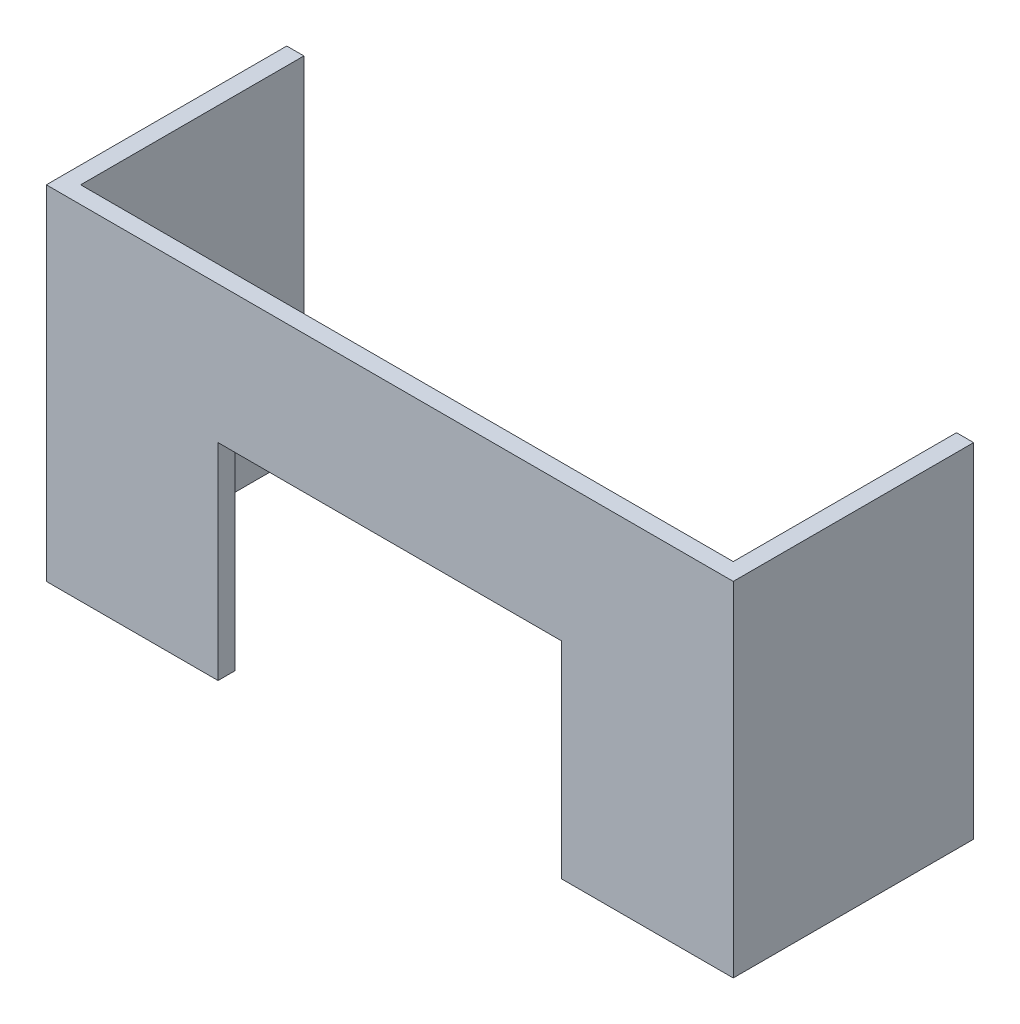
ISO-10303-21;
HEADER;
FILE_DESCRIPTION(('STEP AP214'),'2;1');
FILE_NAME('part.step','',(''),(''),'','','');
FILE_SCHEMA(('AUTOMOTIVE_DESIGN { 1 0 10303 214 1 1 1 1 }'));
ENDSEC;
DATA;
#1=APPLICATION_CONTEXT('core data for automotive mechanical design processes');
#2=APPLICATION_PROTOCOL_DEFINITION('international standard','automotive_design',2000,#1);
#3=PRODUCT_CONTEXT('',#1,'mechanical');
#4=PRODUCT('Part','Part','',(#3));
#5=PRODUCT_RELATED_PRODUCT_CATEGORY('part','',(#4));
#6=PRODUCT_DEFINITION_FORMATION('','',#4);
#7=PRODUCT_DEFINITION_CONTEXT('part definition',#1,'design');
#8=PRODUCT_DEFINITION('design','',#6,#7);
#9=PRODUCT_DEFINITION_SHAPE('','',#8);
#10=(LENGTH_UNIT() NAMED_UNIT(*) SI_UNIT(.MILLI.,.METRE.));
#11=(NAMED_UNIT(*) PLANE_ANGLE_UNIT() SI_UNIT($,.RADIAN.));
#12=(NAMED_UNIT(*) SI_UNIT($,.STERADIAN.) SOLID_ANGLE_UNIT());
#13=UNCERTAINTY_MEASURE_WITH_UNIT(LENGTH_MEASURE(1.E-05),#10,'distance_accuracy_value','');
#14=(GEOMETRIC_REPRESENTATION_CONTEXT(3) GLOBAL_UNCERTAINTY_ASSIGNED_CONTEXT((#13)) GLOBAL_UNIT_ASSIGNED_CONTEXT((#10,
#11,#12)) REPRESENTATION_CONTEXT('',''));
#15=CARTESIAN_POINT('',(0.,0.,0.));
#16=DIRECTION('',(0.,0.,1.));
#17=DIRECTION('',(1.,0.,0.));
#18=AXIS2_PLACEMENT_3D('',#15,#16,#17);
#19=CARTESIAN_POINT('',(200.,200.,-75.));
#20=DIRECTION('',(-1.,0.,0.));
#21=DIRECTION('',(0.,0.,1.));
#22=AXIS2_PLACEMENT_3D('',#19,#20,#21);
#23=PLANE('',#22);
#24=DIRECTION('',(0.,-1.,0.));
#25=VECTOR('',#24,1.);
#26=CARTESIAN_POINT('',(200.,200.,-65.));
#27=LINE('',#26,#25);
#28=CARTESIAN_POINT('',(200.,200.,-65.));
#29=VERTEX_POINT('',#28);
#30=CARTESIAN_POINT('',(200.,0.,-65.));
#31=VERTEX_POINT('',#30);
#32=EDGE_CURVE('E244',#29,#31,#27,.T.);
#33=ORIENTED_EDGE('',*,*,#32,.F.);
#34=DIRECTION('',(0.,0.,-1.));
#35=VECTOR('',#34,1.);
#36=CARTESIAN_POINT('',(200.,200.,-75.));
#37=LINE('',#36,#35);
#38=CARTESIAN_POINT('',(200.,200.,75.));
#39=VERTEX_POINT('',#38);
#40=EDGE_CURVE('E94',#39,#29,#37,.T.);
#41=ORIENTED_EDGE('',*,*,#40,.F.);
#42=DIRECTION('',(0.,-1.,0.));
#43=VECTOR('',#42,1.);
#44=CARTESIAN_POINT('',(200.,200.,75.));
#45=LINE('',#44,#43);
#46=CARTESIAN_POINT('',(200.,0.,75.));
#47=VERTEX_POINT('',#46);
#48=EDGE_CURVE('E78',#39,#47,#45,.T.);
#49=ORIENTED_EDGE('',*,*,#48,.T.);
#50=DIRECTION('',(0.,0.,-1.));
#51=VECTOR('',#50,1.);
#52=CARTESIAN_POINT('',(200.,0.,-75.));
#53=LINE('',#52,#51);
#54=EDGE_CURVE('E93',#47,#31,#53,.T.);
#55=ORIENTED_EDGE('',*,*,#54,.T.);
#56=EDGE_LOOP('',(#33,#41,#49,#55));
#57=FACE_BOUND('',#56,.T.);
#58=ADVANCED_FACE('F38',(#57),#23,.F.);
#59=CARTESIAN_POINT('',(-200.,200.,-75.));
#60=DIRECTION('',(1.,0.,0.));
#61=DIRECTION('',(0.,0.,-1.));
#62=AXIS2_PLACEMENT_3D('',#59,#60,#61);
#63=PLANE('',#62);
#64=DIRECTION('',(0.,1.,0.));
#65=VECTOR('',#64,1.);
#66=CARTESIAN_POINT('',(-200.,200.,-65.));
#67=LINE('',#66,#65);
#68=CARTESIAN_POINT('',(-200.,0.,-65.));
#69=VERTEX_POINT('',#68);
#70=CARTESIAN_POINT('',(-200.,200.,-65.));
#71=VERTEX_POINT('',#70);
#72=EDGE_CURVE('E229',#69,#71,#67,.T.);
#73=ORIENTED_EDGE('',*,*,#72,.F.);
#74=DIRECTION('',(0.,0.,1.));
#75=VECTOR('',#74,1.);
#76=CARTESIAN_POINT('',(-200.,0.,-75.));
#77=LINE('',#76,#75);
#78=CARTESIAN_POINT('',(-200.,0.,75.));
#79=VERTEX_POINT('',#78);
#80=EDGE_CURVE('E87',#69,#79,#77,.T.);
#81=ORIENTED_EDGE('',*,*,#80,.T.);
#82=DIRECTION('',(0.,-1.,0.));
#83=VECTOR('',#82,1.);
#84=CARTESIAN_POINT('',(-200.,200.,75.));
#85=LINE('',#84,#83);
#86=CARTESIAN_POINT('',(-200.,200.,75.));
#87=VERTEX_POINT('',#86);
#88=EDGE_CURVE('E95',#87,#79,#85,.T.);
#89=ORIENTED_EDGE('',*,*,#88,.F.);
#90=DIRECTION('',(0.,0.,1.));
#91=VECTOR('',#90,1.);
#92=CARTESIAN_POINT('',(-200.,200.,-75.));
#93=LINE('',#92,#91);
#94=EDGE_CURVE('E175',#71,#87,#93,.T.);
#95=ORIENTED_EDGE('',*,*,#94,.F.);
#96=EDGE_LOOP('',(#73,#81,#89,#95));
#97=FACE_BOUND('',#96,.T.);
#98=ADVANCED_FACE('F186',(#97),#63,.F.);
#99=CARTESIAN_POINT('',(0.,200.,0.));
#100=DIRECTION('',(0.,1.,0.));
#101=DIRECTION('',(0.,0.,1.));
#102=AXIS2_PLACEMENT_3D('',#99,#100,#101);
#103=PLANE('',#102);
#104=ORIENTED_EDGE('',*,*,#40,.T.);
#105=DIRECTION('',(1.,0.,0.));
#106=VECTOR('',#105,1.);
#107=CARTESIAN_POINT('',(200.,200.,-65.));
#108=LINE('',#107,#106);
#109=CARTESIAN_POINT('',(190.,200.,-65.));
#110=VERTEX_POINT('',#109);
#111=EDGE_CURVE('E223',#110,#29,#108,.T.);
#112=ORIENTED_EDGE('',*,*,#111,.F.);
#113=DIRECTION('',(0.,0.,-1.));
#114=VECTOR('',#113,1.);
#115=CARTESIAN_POINT('',(190.,200.,-65.));
#116=LINE('',#115,#114);
#117=CARTESIAN_POINT('',(190.,200.,65.));
#118=VERTEX_POINT('',#117);
#119=EDGE_CURVE('E139',#118,#110,#116,.T.);
#120=ORIENTED_EDGE('',*,*,#119,.F.);
#121=DIRECTION('',(1.,0.,0.));
#122=VECTOR('',#121,1.);
#123=CARTESIAN_POINT('',(-190.,200.,65.));
#124=LINE('',#123,#122);
#125=CARTESIAN_POINT('',(-190.,200.,65.));
#126=VERTEX_POINT('',#125);
#127=EDGE_CURVE('E157',#126,#118,#124,.T.);
#128=ORIENTED_EDGE('',*,*,#127,.F.);
#129=DIRECTION('',(0.,0.,1.));
#130=VECTOR('',#129,1.);
#131=CARTESIAN_POINT('',(-190.,200.,-65.));
#132=LINE('',#131,#130);
#133=CARTESIAN_POINT('',(-190.,200.,-65.));
#134=VERTEX_POINT('',#133);
#135=EDGE_CURVE('E142',#134,#126,#132,.T.);
#136=ORIENTED_EDGE('',*,*,#135,.F.);
#137=EDGE_CURVE('E183',#71,#134,#108,.T.);
#138=ORIENTED_EDGE('',*,*,#137,.F.);
#139=ORIENTED_EDGE('',*,*,#94,.T.);
#140=DIRECTION('',(1.,0.,0.));
#141=VECTOR('',#140,1.);
#142=CARTESIAN_POINT('',(-200.,200.,75.));
#143=LINE('',#142,#141);
#144=EDGE_CURVE('E61',#87,#39,#143,.T.);
#145=ORIENTED_EDGE('',*,*,#144,.T.);
#146=EDGE_LOOP('',(#104,#112,#120,#128,#136,#138,#139,#145));
#147=FACE_BOUND('',#146,.T.);
#148=ADVANCED_FACE('F179',(#147),#103,.T.);
#149=CARTESIAN_POINT('',(0.,0.,0.));
#150=DIRECTION('',(0.,1.,0.));
#151=DIRECTION('',(0.,0.,1.));
#152=AXIS2_PLACEMENT_3D('',#149,#150,#151);
#153=PLANE('',#152);
#154=DIRECTION('',(-1.,0.,0.));
#155=VECTOR('',#154,1.);
#156=CARTESIAN_POINT('',(200.,0.,-65.));
#157=LINE('',#156,#155);
#158=CARTESIAN_POINT('',(190.,0.,-65.));
#159=VERTEX_POINT('',#158);
#160=EDGE_CURVE('E101',#31,#159,#157,.T.);
#161=ORIENTED_EDGE('',*,*,#160,.F.);
#162=ORIENTED_EDGE('',*,*,#54,.F.);
#163=DIRECTION('',(1.,0.,0.));
#164=VECTOR('',#163,1.);
#165=CARTESIAN_POINT('',(-200.,0.,75.));
#166=LINE('',#165,#164);
#167=CARTESIAN_POINT('',(100.,0.,75.));
#168=VERTEX_POINT('',#167);
#169=EDGE_CURVE('E74',#168,#47,#166,.T.);
#170=ORIENTED_EDGE('',*,*,#169,.F.);
#171=DIRECTION('',(0.,0.,1.));
#172=VECTOR('',#171,1.);
#173=CARTESIAN_POINT('',(100.,0.,55.));
#174=LINE('',#173,#172);
#175=CARTESIAN_POINT('',(100.,0.,65.));
#176=VERTEX_POINT('',#175);
#177=EDGE_CURVE('E144',#176,#168,#174,.T.);
#178=ORIENTED_EDGE('',*,*,#177,.F.);
#179=DIRECTION('',(1.,0.,0.));
#180=VECTOR('',#179,1.);
#181=CARTESIAN_POINT('',(-190.,0.,65.));
#182=LINE('',#181,#180);
#183=CARTESIAN_POINT('',(190.,0.,65.));
#184=VERTEX_POINT('',#183);
#185=EDGE_CURVE('E160',#176,#184,#182,.T.);
#186=ORIENTED_EDGE('',*,*,#185,.T.);
#187=DIRECTION('',(0.,0.,-1.));
#188=VECTOR('',#187,1.);
#189=CARTESIAN_POINT('',(190.,0.,-65.));
#190=LINE('',#189,#188);
#191=EDGE_CURVE('E154',#184,#159,#190,.T.);
#192=ORIENTED_EDGE('',*,*,#191,.T.);
#193=EDGE_LOOP('',(#161,#162,#170,#178,#186,#192));
#194=FACE_BOUND('',#193,.T.);
#195=ADVANCED_FACE('F98',(#194),#153,.F.);
#196=CARTESIAN_POINT('',(-190.,0.,-65.));
#197=VERTEX_POINT('',#196);
#198=EDGE_CURVE('E246',#197,#69,#157,.T.);
#199=ORIENTED_EDGE('',*,*,#198,.F.);
#200=DIRECTION('',(0.,0.,1.));
#201=VECTOR('',#200,1.);
#202=CARTESIAN_POINT('',(-190.,0.,-65.));
#203=LINE('',#202,#201);
#204=CARTESIAN_POINT('',(-190.,0.,65.));
#205=VERTEX_POINT('',#204);
#206=EDGE_CURVE('E156',#197,#205,#203,.T.);
#207=ORIENTED_EDGE('',*,*,#206,.T.);
#208=CARTESIAN_POINT('',(-100.,0.,65.));
#209=VERTEX_POINT('',#208);
#210=EDGE_CURVE('E161',#205,#209,#182,.T.);
#211=ORIENTED_EDGE('',*,*,#210,.T.);
#212=DIRECTION('',(0.,0.,1.));
#213=VECTOR('',#212,1.);
#214=CARTESIAN_POINT('',(-100.,0.,55.));
#215=LINE('',#214,#213);
#216=CARTESIAN_POINT('',(-100.,0.,75.));
#217=VERTEX_POINT('',#216);
#218=EDGE_CURVE('E151',#209,#217,#215,.T.);
#219=ORIENTED_EDGE('',*,*,#218,.T.);
#220=EDGE_CURVE('E86',#79,#217,#166,.T.);
#221=ORIENTED_EDGE('',*,*,#220,.F.);
#222=ORIENTED_EDGE('',*,*,#80,.F.);
#223=EDGE_LOOP('',(#199,#207,#211,#219,#221,#222));
#224=FACE_BOUND('',#223,.T.);
#225=ADVANCED_FACE('F192',(#224),#153,.F.);
#226=CARTESIAN_POINT('',(-200.,200.,75.));
#227=DIRECTION('',(0.,0.,-1.));
#228=DIRECTION('',(-1.,0.,0.));
#229=AXIS2_PLACEMENT_3D('',#226,#227,#228);
#230=PLANE('',#229);
#231=ORIENTED_EDGE('',*,*,#220,.T.);
#232=DIRECTION('',(0.,-1.,0.));
#233=VECTOR('',#232,1.);
#234=CARTESIAN_POINT('',(-100.,120.,75.));
#235=LINE('',#234,#233);
#236=CARTESIAN_POINT('',(-100.,120.,75.));
#237=VERTEX_POINT('',#236);
#238=EDGE_CURVE('E198',#237,#217,#235,.T.);
#239=ORIENTED_EDGE('',*,*,#238,.F.);
#240=DIRECTION('',(-1.,0.,0.));
#241=VECTOR('',#240,1.);
#242=CARTESIAN_POINT('',(-100.,120.,75.));
#243=LINE('',#242,#241);
#244=CARTESIAN_POINT('',(100.,120.,75.));
#245=VERTEX_POINT('',#244);
#246=EDGE_CURVE('E135',#245,#237,#243,.T.);
#247=ORIENTED_EDGE('',*,*,#246,.F.);
#248=DIRECTION('',(0.,1.,0.));
#249=VECTOR('',#248,1.);
#250=CARTESIAN_POINT('',(100.,120.,75.));
#251=LINE('',#250,#249);
#252=EDGE_CURVE('E82',#168,#245,#251,.T.);
#253=ORIENTED_EDGE('',*,*,#252,.F.);
#254=ORIENTED_EDGE('',*,*,#169,.T.);
#255=ORIENTED_EDGE('',*,*,#48,.F.);
#256=ORIENTED_EDGE('',*,*,#144,.F.);
#257=ORIENTED_EDGE('',*,*,#88,.T.);
#258=EDGE_LOOP('',(#231,#239,#247,#253,#254,#255,#256,#257));
#259=FACE_BOUND('',#258,.T.);
#260=ADVANCED_FACE('F77',(#259),#230,.F.);
#261=CARTESIAN_POINT('',(190.,0.,-65.));
#262=DIRECTION('',(1.,0.,0.));
#263=DIRECTION('',(0.,0.,-1.));
#264=AXIS2_PLACEMENT_3D('',#261,#262,#263);
#265=PLANE('',#264);
#266=ORIENTED_EDGE('',*,*,#119,.T.);
#267=DIRECTION('',(0.,1.,0.));
#268=VECTOR('',#267,1.);
#269=CARTESIAN_POINT('',(190.,0.,-65.));
#270=LINE('',#269,#268);
#271=EDGE_CURVE('E162',#159,#110,#270,.T.);
#272=ORIENTED_EDGE('',*,*,#271,.F.);
#273=ORIENTED_EDGE('',*,*,#191,.F.);
#274=DIRECTION('',(0.,1.,0.));
#275=VECTOR('',#274,1.);
#276=CARTESIAN_POINT('',(190.,0.,65.));
#277=LINE('',#276,#275);
#278=EDGE_CURVE('E102',#184,#118,#277,.T.);
#279=ORIENTED_EDGE('',*,*,#278,.T.);
#280=EDGE_LOOP('',(#266,#272,#273,#279));
#281=FACE_BOUND('',#280,.T.);
#282=ADVANCED_FACE('F217',(#281),#265,.F.);
#283=CARTESIAN_POINT('',(-190.,0.,65.));
#284=DIRECTION('',(0.,0.,1.));
#285=DIRECTION('',(1.,0.,0.));
#286=AXIS2_PLACEMENT_3D('',#283,#284,#285);
#287=PLANE('',#286);
#288=DIRECTION('',(-1.,0.,0.));
#289=VECTOR('',#288,1.);
#290=CARTESIAN_POINT('',(-190.,120.,65.));
#291=LINE('',#290,#289);
#292=CARTESIAN_POINT('',(100.,120.,65.));
#293=VERTEX_POINT('',#292);
#294=CARTESIAN_POINT('',(-100.,120.,65.));
#295=VERTEX_POINT('',#294);
#296=EDGE_CURVE('E45',#293,#295,#291,.T.);
#297=ORIENTED_EDGE('',*,*,#296,.T.);
#298=DIRECTION('',(0.,-1.,0.));
#299=VECTOR('',#298,1.);
#300=CARTESIAN_POINT('',(-100.,0.,65.));
#301=LINE('',#300,#299);
#302=EDGE_CURVE('E11',#295,#209,#301,.T.);
#303=ORIENTED_EDGE('',*,*,#302,.T.);
#304=ORIENTED_EDGE('',*,*,#210,.F.);
#305=DIRECTION('',(0.,1.,0.));
#306=VECTOR('',#305,1.);
#307=CARTESIAN_POINT('',(-190.,0.,65.));
#308=LINE('',#307,#306);
#309=EDGE_CURVE('E106',#205,#126,#308,.T.);
#310=ORIENTED_EDGE('',*,*,#309,.T.);
#311=ORIENTED_EDGE('',*,*,#127,.T.);
#312=ORIENTED_EDGE('',*,*,#278,.F.);
#313=ORIENTED_EDGE('',*,*,#185,.F.);
#314=DIRECTION('',(0.,1.,0.));
#315=VECTOR('',#314,1.);
#316=CARTESIAN_POINT('',(100.,0.,65.));
#317=LINE('',#316,#315);
#318=EDGE_CURVE('E113',#176,#293,#317,.T.);
#319=ORIENTED_EDGE('',*,*,#318,.T.);
#320=EDGE_LOOP('',(#297,#303,#304,#310,#311,#312,#313,#319));
#321=FACE_BOUND('',#320,.T.);
#322=ADVANCED_FACE('F118',(#321),#287,.F.);
#323=CARTESIAN_POINT('',(-190.,0.,-65.));
#324=DIRECTION('',(-1.,0.,0.));
#325=DIRECTION('',(0.,0.,1.));
#326=AXIS2_PLACEMENT_3D('',#323,#324,#325);
#327=PLANE('',#326);
#328=ORIENTED_EDGE('',*,*,#135,.T.);
#329=ORIENTED_EDGE('',*,*,#309,.F.);
#330=ORIENTED_EDGE('',*,*,#206,.F.);
#331=DIRECTION('',(0.,1.,0.));
#332=VECTOR('',#331,1.);
#333=CARTESIAN_POINT('',(-190.,0.,-65.));
#334=LINE('',#333,#332);
#335=EDGE_CURVE('E170',#197,#134,#334,.T.);
#336=ORIENTED_EDGE('',*,*,#335,.T.);
#337=EDGE_LOOP('',(#328,#329,#330,#336));
#338=FACE_BOUND('',#337,.T.);
#339=ADVANCED_FACE('F252',(#338),#327,.F.);
#340=CARTESIAN_POINT('',(-100.,120.,55.));
#341=DIRECTION('',(-1.,0.,0.));
#342=DIRECTION('',(0.,-1.,0.));
#343=AXIS2_PLACEMENT_3D('',#340,#341,#342);
#344=PLANE('',#343);
#345=DIRECTION('',(0.,0.,1.));
#346=VECTOR('',#345,1.);
#347=CARTESIAN_POINT('',(-100.,120.,55.));
#348=LINE('',#347,#346);
#349=EDGE_CURVE('E133',#295,#237,#348,.T.);
#350=ORIENTED_EDGE('',*,*,#349,.T.);
#351=ORIENTED_EDGE('',*,*,#238,.T.);
#352=ORIENTED_EDGE('',*,*,#218,.F.);
#353=ORIENTED_EDGE('',*,*,#302,.F.);
#354=EDGE_LOOP('',(#350,#351,#352,#353));
#355=FACE_BOUND('',#354,.T.);
#356=ADVANCED_FACE('F197',(#355),#344,.F.);
#357=CARTESIAN_POINT('',(-100.,120.,55.));
#358=DIRECTION('',(0.,1.,0.));
#359=DIRECTION('',(0.,0.,1.));
#360=AXIS2_PLACEMENT_3D('',#357,#358,#359);
#361=PLANE('',#360);
#362=DIRECTION('',(0.,0.,1.));
#363=VECTOR('',#362,1.);
#364=CARTESIAN_POINT('',(100.,120.,55.));
#365=LINE('',#364,#363);
#366=EDGE_CURVE('E52',#293,#245,#365,.T.);
#367=ORIENTED_EDGE('',*,*,#366,.T.);
#368=ORIENTED_EDGE('',*,*,#246,.T.);
#369=ORIENTED_EDGE('',*,*,#349,.F.);
#370=ORIENTED_EDGE('',*,*,#296,.F.);
#371=EDGE_LOOP('',(#367,#368,#369,#370));
#372=FACE_BOUND('',#371,.T.);
#373=ADVANCED_FACE('F129',(#372),#361,.F.);
#374=CARTESIAN_POINT('',(100.,120.,55.));
#375=DIRECTION('',(1.,0.,0.));
#376=DIRECTION('',(0.,0.,-1.));
#377=AXIS2_PLACEMENT_3D('',#374,#375,#376);
#378=PLANE('',#377);
#379=ORIENTED_EDGE('',*,*,#177,.T.);
#380=ORIENTED_EDGE('',*,*,#252,.T.);
#381=ORIENTED_EDGE('',*,*,#366,.F.);
#382=ORIENTED_EDGE('',*,*,#318,.F.);
#383=EDGE_LOOP('',(#379,#380,#381,#382));
#384=FACE_BOUND('',#383,.T.);
#385=ADVANCED_FACE('F235',(#384),#378,.F.);
#386=CARTESIAN_POINT('',(0.,0.,-65.));
#387=DIRECTION('',(0.,0.,-1.));
#388=DIRECTION('',(-1.,0.,0.));
#389=AXIS2_PLACEMENT_3D('',#386,#387,#388);
#390=PLANE('',#389);
#391=ORIENTED_EDGE('',*,*,#335,.F.);
#392=ORIENTED_EDGE('',*,*,#198,.T.);
#393=ORIENTED_EDGE('',*,*,#72,.T.);
#394=ORIENTED_EDGE('',*,*,#137,.T.);
#395=EDGE_LOOP('',(#391,#392,#393,#394));
#396=FACE_BOUND('',#395,.T.);
#397=ADVANCED_FACE('F249',(#396),#390,.T.);
#398=ORIENTED_EDGE('',*,*,#271,.T.);
#399=ORIENTED_EDGE('',*,*,#111,.T.);
#400=ORIENTED_EDGE('',*,*,#32,.T.);
#401=ORIENTED_EDGE('',*,*,#160,.T.);
#402=EDGE_LOOP('',(#398,#399,#400,#401));
#403=FACE_BOUND('',#402,.T.);
#404=ADVANCED_FACE('F245',(#403),#390,.T.);
#405=CLOSED_SHELL('',(#58,#98,#148,#195,#225,#260,#282,#322,#339,#356,#373,#385,#397,#404));
#406=MANIFOLD_SOLID_BREP('B2',#405);
#407=ADVANCED_BREP_SHAPE_REPRESENTATION('',(#18,#406),#14);
#408=SHAPE_DEFINITION_REPRESENTATION(#9,#407);
ENDSEC;
END-ISO-10303-21;
